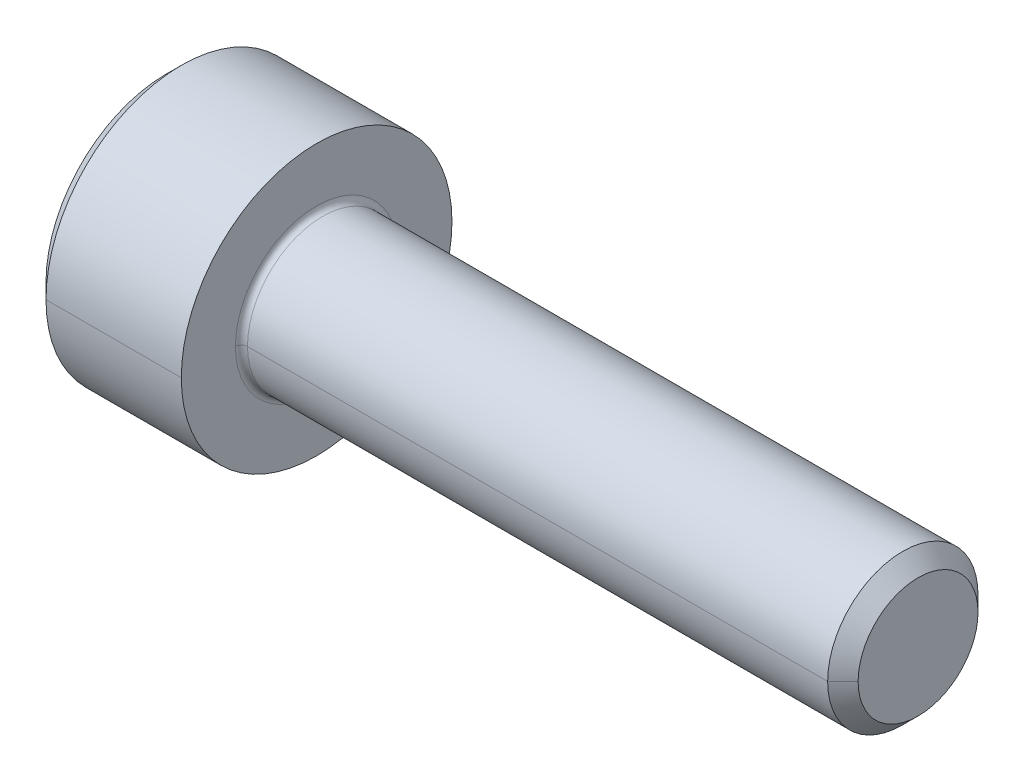
ISO-10303-21;
HEADER;
FILE_DESCRIPTION(('STEP AP214'),'2;1');
FILE_NAME('part.step','',(''),(''),'','','');
FILE_SCHEMA(('AUTOMOTIVE_DESIGN { 1 0 10303 214 1 1 1 1 }'));
ENDSEC;
DATA;
#1=APPLICATION_CONTEXT('core data for automotive mechanical design processes');
#2=APPLICATION_PROTOCOL_DEFINITION('international standard','automotive_design',2000,#1);
#3=PRODUCT_CONTEXT('',#1,'mechanical');
#4=PRODUCT('Part','Part','',(#3));
#5=PRODUCT_RELATED_PRODUCT_CATEGORY('part','',(#4));
#6=PRODUCT_DEFINITION_FORMATION('','',#4);
#7=PRODUCT_DEFINITION_CONTEXT('part definition',#1,'design');
#8=PRODUCT_DEFINITION('design','',#6,#7);
#9=PRODUCT_DEFINITION_SHAPE('','',#8);
#10=(LENGTH_UNIT() NAMED_UNIT(*) SI_UNIT(.MILLI.,.METRE.));
#11=(NAMED_UNIT(*) PLANE_ANGLE_UNIT() SI_UNIT($,.RADIAN.));
#12=(NAMED_UNIT(*) SI_UNIT($,.STERADIAN.) SOLID_ANGLE_UNIT());
#13=UNCERTAINTY_MEASURE_WITH_UNIT(LENGTH_MEASURE(1.E-05),#10,'distance_accuracy_value','');
#14=(GEOMETRIC_REPRESENTATION_CONTEXT(3) GLOBAL_UNCERTAINTY_ASSIGNED_CONTEXT((#13)) GLOBAL_UNIT_ASSIGNED_CONTEXT((#10,
#11,#12)) REPRESENTATION_CONTEXT('',''));
#15=CARTESIAN_POINT('',(0.,0.,0.));
#16=DIRECTION('',(0.,0.,1.));
#17=DIRECTION('',(1.,0.,0.));
#18=AXIS2_PLACEMENT_3D('',#15,#16,#17);
#19=CARTESIAN_POINT('',(1.1,0.,0.));
#20=DIRECTION('',(-1.,0.,0.));
#21=DIRECTION('',(0.,0.,1.));
#22=AXIS2_PLACEMENT_3D('',#19,#20,#21);
#23=CONICAL_SURFACE('',#22,1.0225,1.04719755119659);
#24=DIRECTION('',(-0.500000000000006,0.,-0.866025403784435));
#25=VECTOR('',#24,1.);
#26=CARTESIAN_POINT('',(1.1,0.,-1.0225));
#27=LINE('',#26,#25);
#28=CARTESIAN_POINT('',(1.6903406502464,0.,0.));
#29=VERTEX_POINT('',#28);
#30=CARTESIAN_POINT('',(1.1,0.,-1.0225));
#31=VERTEX_POINT('',#30);
#32=EDGE_CURVE('E173',#29,#31,#27,.T.);
#33=ORIENTED_EDGE('',*,*,#32,.F.);
#34=DIRECTION('',(-0.500000000000006,0.,0.866025403784435));
#35=VECTOR('',#34,1.);
#36=CARTESIAN_POINT('',(1.1,0.,1.0225));
#37=LINE('',#36,#35);
#38=CARTESIAN_POINT('',(1.1,0.,1.0225));
#39=VERTEX_POINT('',#38);
#40=EDGE_CURVE('E176',#29,#39,#37,.T.);
#41=ORIENTED_EDGE('',*,*,#40,.T.);
#42=CARTESIAN_POINT('',(1.1,0.,0.));
#43=DIRECTION('',(-1.,0.,0.));
#44=DIRECTION('',(0.,0.,1.));
#45=AXIS2_PLACEMENT_3D('',#42,#43,#44);
#46=CIRCLE('',#45,1.0225);
#47=CARTESIAN_POINT('',(1.1,0.885510975369586,0.51125));
#48=VERTEX_POINT('',#47);
#49=EDGE_CURVE('E196',#39,#48,#46,.T.);
#50=ORIENTED_EDGE('',*,*,#49,.T.);
#51=CARTESIAN_POINT('',(1.1,0.,0.));
#52=DIRECTION('',(-1.,0.,0.));
#53=DIRECTION('',(0.,0.,1.));
#54=AXIS2_PLACEMENT_3D('',#51,#52,#53);
#55=CIRCLE('',#54,1.0225);
#56=CARTESIAN_POINT('',(1.1,0.885510975369585,-0.51125));
#57=VERTEX_POINT('',#56);
#58=EDGE_CURVE('E25',#48,#57,#55,.T.);
#59=ORIENTED_EDGE('',*,*,#58,.T.);
#60=CARTESIAN_POINT('',(1.1,0.,0.));
#61=DIRECTION('',(-1.,0.,0.));
#62=DIRECTION('',(0.,0.,1.));
#63=AXIS2_PLACEMENT_3D('',#60,#61,#62);
#64=CIRCLE('',#63,1.0225);
#65=EDGE_CURVE('E11',#57,#31,#64,.T.);
#66=ORIENTED_EDGE('',*,*,#65,.T.);
#67=EDGE_LOOP('',(#33,#41,#50,#59,#66));
#68=FACE_BOUND('',#67,.T.);
#69=ADVANCED_FACE('F16',(#68),#23,.F.);
#70=CARTESIAN_POINT('',(1.1,1.77102195073917,-1.0225));
#71=DIRECTION('',(1.,0.,0.));
#72=DIRECTION('',(0.,1.,0.));
#73=AXIS2_PLACEMENT_3D('',#70,#71,#72);
#74=PLANE('',#73);
#75=DIRECTION('',(0.,-0.5,-0.866025403784438));
#76=VECTOR('',#75,1.);
#77=CARTESIAN_POINT('',(1.1,1.18068130049278,0.));
#78=LINE('',#77,#76);
#79=CARTESIAN_POINT('',(1.1,0.590340650246387,-1.0225));
#80=VERTEX_POINT('',#79);
#81=EDGE_CURVE('E44',#57,#80,#78,.T.);
#82=ORIENTED_EDGE('',*,*,#81,.T.);
#83=DIRECTION('',(0.,-1.,0.));
#84=VECTOR('',#83,1.);
#85=CARTESIAN_POINT('',(1.1,0.590340650246387,-1.0225));
#86=LINE('',#85,#84);
#87=EDGE_CURVE('E258',#80,#31,#86,.T.);
#88=ORIENTED_EDGE('',*,*,#87,.T.);
#89=ORIENTED_EDGE('',*,*,#65,.F.);
#90=EDGE_LOOP('',(#82,#88,#89));
#91=FACE_BOUND('',#90,.T.);
#92=ADVANCED_FACE('F416',(#91),#74,.F.);
#93=CARTESIAN_POINT('',(1.1,1.77102195073917,-1.0225));
#94=DIRECTION('',(1.,0.,0.));
#95=DIRECTION('',(0.,1.,0.));
#96=AXIS2_PLACEMENT_3D('',#93,#94,#95);
#97=PLANE('',#96);
#98=DIRECTION('',(0.,-0.5,0.86602540378444));
#99=VECTOR('',#98,1.);
#100=CARTESIAN_POINT('',(1.1,1.18068130049278,0.));
#101=LINE('',#100,#99);
#102=CARTESIAN_POINT('',(1.1,1.18068130049278,0.));
#103=VERTEX_POINT('',#102);
#104=EDGE_CURVE('E211',#103,#48,#101,.T.);
#105=ORIENTED_EDGE('',*,*,#104,.F.);
#106=DIRECTION('',(0.,-0.5,-0.866025403784438));
#107=VECTOR('',#106,1.);
#108=CARTESIAN_POINT('',(1.1,1.18068130049278,0.));
#109=LINE('',#108,#107);
#110=EDGE_CURVE('E199',#103,#57,#109,.T.);
#111=ORIENTED_EDGE('',*,*,#110,.T.);
#112=ORIENTED_EDGE('',*,*,#58,.F.);
#113=EDGE_LOOP('',(#105,#111,#112));
#114=FACE_BOUND('',#113,.T.);
#115=ADVANCED_FACE('F411',(#114),#97,.F.);
#116=CARTESIAN_POINT('',(1.1,1.77102195073917,-1.0225));
#117=DIRECTION('',(1.,0.,0.));
#118=DIRECTION('',(0.,1.,0.));
#119=AXIS2_PLACEMENT_3D('',#116,#117,#118);
#120=PLANE('',#119);
#121=DIRECTION('',(0.,1.,0.));
#122=VECTOR('',#121,1.);
#123=CARTESIAN_POINT('',(1.1,-0.590340650246394,1.0225));
#124=LINE('',#123,#122);
#125=CARTESIAN_POINT('',(1.1,0.590340650246391,1.0225));
#126=VERTEX_POINT('',#125);
#127=EDGE_CURVE('E342',#39,#126,#124,.T.);
#128=ORIENTED_EDGE('',*,*,#127,.T.);
#129=DIRECTION('',(0.,-0.5,0.86602540378444));
#130=VECTOR('',#129,1.);
#131=CARTESIAN_POINT('',(1.1,1.18068130049278,0.));
#132=LINE('',#131,#130);
#133=EDGE_CURVE('E206',#48,#126,#132,.T.);
#134=ORIENTED_EDGE('',*,*,#133,.F.);
#135=ORIENTED_EDGE('',*,*,#49,.F.);
#136=EDGE_LOOP('',(#128,#134,#135));
#137=FACE_BOUND('',#136,.T.);
#138=ADVANCED_FACE('F408',(#137),#120,.F.);
#139=CARTESIAN_POINT('',(1.1,1.77102195073917,-1.0225));
#140=DIRECTION('',(1.,0.,0.));
#141=DIRECTION('',(0.,1.,0.));
#142=AXIS2_PLACEMENT_3D('',#139,#140,#141);
#143=PLANE('',#142);
#144=DIRECTION('',(0.,-0.5,-0.866025403784438));
#145=VECTOR('',#144,1.);
#146=CARTESIAN_POINT('',(1.1,-0.590340650246394,1.0225));
#147=LINE('',#146,#145);
#148=CARTESIAN_POINT('',(1.1,-0.590340650246394,1.0225));
#149=VERTEX_POINT('',#148);
#150=CARTESIAN_POINT('',(1.1,-0.88551097536959,0.51125));
#151=VERTEX_POINT('',#150);
#152=EDGE_CURVE('E352',#149,#151,#147,.T.);
#153=ORIENTED_EDGE('',*,*,#152,.F.);
#154=DIRECTION('',(0.,1.,0.));
#155=VECTOR('',#154,1.);
#156=CARTESIAN_POINT('',(1.1,-0.590340650246394,1.0225));
#157=LINE('',#156,#155);
#158=EDGE_CURVE('E345',#149,#39,#157,.T.);
#159=ORIENTED_EDGE('',*,*,#158,.T.);
#160=CARTESIAN_POINT('',(1.1,0.,0.));
#161=DIRECTION('',(-1.,0.,0.));
#162=DIRECTION('',(0.,0.,1.));
#163=AXIS2_PLACEMENT_3D('',#160,#161,#162);
#164=CIRCLE('',#163,1.0225);
#165=EDGE_CURVE('E186',#151,#39,#164,.T.);
#166=ORIENTED_EDGE('',*,*,#165,.F.);
#167=EDGE_LOOP('',(#153,#159,#166));
#168=FACE_BOUND('',#167,.T.);
#169=ADVANCED_FACE('F401',(#168),#143,.F.);
#170=CARTESIAN_POINT('',(1.1,1.77102195073917,-1.0225));
#171=DIRECTION('',(1.,0.,0.));
#172=DIRECTION('',(0.,1.,0.));
#173=AXIS2_PLACEMENT_3D('',#170,#171,#172);
#174=PLANE('',#173);
#175=DIRECTION('',(0.,0.5,-0.86602540378444));
#176=VECTOR('',#175,1.);
#177=CARTESIAN_POINT('',(1.1,-1.18068130049279,0.));
#178=LINE('',#177,#176);
#179=CARTESIAN_POINT('',(1.1,-1.18068130049279,0.));
#180=VERTEX_POINT('',#179);
#181=CARTESIAN_POINT('',(1.1,-0.885510975369592,-0.51125));
#182=VERTEX_POINT('',#181);
#183=EDGE_CURVE('E363',#180,#182,#178,.T.);
#184=ORIENTED_EDGE('',*,*,#183,.F.);
#185=DIRECTION('',(0.,-0.5,-0.866025403784438));
#186=VECTOR('',#185,1.);
#187=CARTESIAN_POINT('',(1.1,-0.590340650246394,1.0225));
#188=LINE('',#187,#186);
#189=EDGE_CURVE('E356',#151,#180,#188,.T.);
#190=ORIENTED_EDGE('',*,*,#189,.F.);
#191=CARTESIAN_POINT('',(1.1,0.,0.));
#192=DIRECTION('',(-1.,0.,0.));
#193=DIRECTION('',(0.,0.,1.));
#194=AXIS2_PLACEMENT_3D('',#191,#192,#193);
#195=CIRCLE('',#194,1.0225);
#196=EDGE_CURVE('E195',#182,#151,#195,.T.);
#197=ORIENTED_EDGE('',*,*,#196,.F.);
#198=EDGE_LOOP('',(#184,#190,#197));
#199=FACE_BOUND('',#198,.T.);
#200=ADVANCED_FACE('F394',(#199),#174,.F.);
#201=CARTESIAN_POINT('',(1.1,1.77102195073917,-1.0225));
#202=DIRECTION('',(1.,0.,0.));
#203=DIRECTION('',(0.,1.,0.));
#204=AXIS2_PLACEMENT_3D('',#201,#202,#203);
#205=PLANE('',#204);
#206=DIRECTION('',(0.,-1.,0.));
#207=VECTOR('',#206,1.);
#208=CARTESIAN_POINT('',(1.1,0.590340650246387,-1.0225));
#209=LINE('',#208,#207);
#210=CARTESIAN_POINT('',(1.1,-0.590340650246397,-1.0225));
#211=VERTEX_POINT('',#210);
#212=EDGE_CURVE('E19',#31,#211,#209,.T.);
#213=ORIENTED_EDGE('',*,*,#212,.T.);
#214=DIRECTION('',(0.,0.5,-0.86602540378444));
#215=VECTOR('',#214,1.);
#216=CARTESIAN_POINT('',(1.1,-1.18068130049279,0.));
#217=LINE('',#216,#215);
#218=EDGE_CURVE('E367',#182,#211,#217,.T.);
#219=ORIENTED_EDGE('',*,*,#218,.F.);
#220=CARTESIAN_POINT('',(1.1,0.,0.));
#221=DIRECTION('',(-1.,0.,0.));
#222=DIRECTION('',(0.,0.,1.));
#223=AXIS2_PLACEMENT_3D('',#220,#221,#222);
#224=CIRCLE('',#223,1.0225);
#225=EDGE_CURVE('E180',#31,#182,#224,.T.);
#226=ORIENTED_EDGE('',*,*,#225,.F.);
#227=EDGE_LOOP('',(#213,#219,#226));
#228=FACE_BOUND('',#227,.T.);
#229=ADVANCED_FACE('F385',(#228),#205,.F.);
#230=CARTESIAN_POINT('',(1.1,1.18068130049278,0.));
#231=DIRECTION('',(0.,0.866025403784438,-0.5));
#232=DIRECTION('',(-1.,0.,0.));
#233=AXIS2_PLACEMENT_3D('',#230,#231,#232);
#234=PLANE('',#233);
#235=DIRECTION('',(0.,-0.5,-0.866025403784438));
#236=VECTOR('',#235,1.);
#237=CARTESIAN_POINT('',(0.,1.18068130049278,0.));
#238=LINE('',#237,#236);
#239=CARTESIAN_POINT('',(0.,1.18068130049278,0.));
#240=VERTEX_POINT('',#239);
#241=CARTESIAN_POINT('',(0.,0.590340650246387,-1.0225));
#242=VERTEX_POINT('',#241);
#243=EDGE_CURVE('E320',#240,#242,#238,.T.);
#244=ORIENTED_EDGE('',*,*,#243,.T.);
#245=DIRECTION('',(-1.,0.,0.));
#246=VECTOR('',#245,1.);
#247=CARTESIAN_POINT('',(1.1,0.590340650246387,-1.0225));
#248=LINE('',#247,#246);
#249=EDGE_CURVE('E255',#80,#242,#248,.T.);
#250=ORIENTED_EDGE('',*,*,#249,.F.);
#251=ORIENTED_EDGE('',*,*,#81,.F.);
#252=ORIENTED_EDGE('',*,*,#110,.F.);
#253=DIRECTION('',(-1.,0.,0.));
#254=VECTOR('',#253,1.);
#255=CARTESIAN_POINT('',(1.1,1.18068130049278,0.));
#256=LINE('',#255,#254);
#257=EDGE_CURVE('E334',#103,#240,#256,.T.);
#258=ORIENTED_EDGE('',*,*,#257,.T.);
#259=EDGE_LOOP('',(#244,#250,#251,#252,#258));
#260=FACE_BOUND('',#259,.T.);
#261=ADVANCED_FACE('F414',(#260),#234,.F.);
#262=CARTESIAN_POINT('',(1.1,0.590340650246387,-1.0225));
#263=DIRECTION('',(0.,0.,-1.));
#264=DIRECTION('',(0.,-1.,0.));
#265=AXIS2_PLACEMENT_3D('',#262,#263,#264);
#266=PLANE('',#265);
#267=DIRECTION('',(0.,-1.,0.));
#268=VECTOR('',#267,1.);
#269=CARTESIAN_POINT('',(0.,0.590340650246387,-1.0225));
#270=LINE('',#269,#268);
#271=CARTESIAN_POINT('',(0.,-0.590340650246397,-1.0225));
#272=VERTEX_POINT('',#271);
#273=EDGE_CURVE('E316',#242,#272,#270,.T.);
#274=ORIENTED_EDGE('',*,*,#273,.T.);
#275=DIRECTION('',(-1.,0.,0.));
#276=VECTOR('',#275,1.);
#277=CARTESIAN_POINT('',(1.1,-0.590340650246397,-1.0225));
#278=LINE('',#277,#276);
#279=EDGE_CURVE('E371',#211,#272,#278,.T.);
#280=ORIENTED_EDGE('',*,*,#279,.F.);
#281=ORIENTED_EDGE('',*,*,#212,.F.);
#282=ORIENTED_EDGE('',*,*,#87,.F.);
#283=ORIENTED_EDGE('',*,*,#249,.T.);
#284=EDGE_LOOP('',(#274,#280,#281,#282,#283));
#285=FACE_BOUND('',#284,.T.);
#286=ADVANCED_FACE('F388',(#285),#266,.F.);
#287=CARTESIAN_POINT('',(1.1,-1.18068130049279,0.));
#288=DIRECTION('',(0.,0.86602540378444,0.5));
#289=DIRECTION('',(1.,0.,0.));
#290=AXIS2_PLACEMENT_3D('',#287,#288,#289);
#291=PLANE('',#290);
#292=DIRECTION('',(0.,0.5,-0.86602540378444));
#293=VECTOR('',#292,1.);
#294=CARTESIAN_POINT('',(0.,-1.18068130049279,0.));
#295=LINE('',#294,#293);
#296=CARTESIAN_POINT('',(0.,-1.18068130049279,0.));
#297=VERTEX_POINT('',#296);
#298=EDGE_CURVE('E290',#297,#272,#295,.T.);
#299=ORIENTED_EDGE('',*,*,#298,.F.);
#300=DIRECTION('',(-1.,0.,0.));
#301=VECTOR('',#300,1.);
#302=CARTESIAN_POINT('',(1.1,-1.18068130049279,0.));
#303=LINE('',#302,#301);
#304=EDGE_CURVE('E360',#180,#297,#303,.T.);
#305=ORIENTED_EDGE('',*,*,#304,.F.);
#306=ORIENTED_EDGE('',*,*,#183,.T.);
#307=ORIENTED_EDGE('',*,*,#218,.T.);
#308=ORIENTED_EDGE('',*,*,#279,.T.);
#309=EDGE_LOOP('',(#299,#305,#306,#307,#308));
#310=FACE_BOUND('',#309,.T.);
#311=ADVANCED_FACE('F390',(#310),#291,.T.);
#312=CARTESIAN_POINT('',(1.1,-0.590340650246394,1.0225));
#313=DIRECTION('',(0.,0.866025403784438,-0.5));
#314=DIRECTION('',(-1.,0.,0.));
#315=AXIS2_PLACEMENT_3D('',#312,#313,#314);
#316=PLANE('',#315);
#317=DIRECTION('',(0.,-0.5,-0.866025403784438));
#318=VECTOR('',#317,1.);
#319=CARTESIAN_POINT('',(0.,-0.590340650246394,1.0225));
#320=LINE('',#319,#318);
#321=CARTESIAN_POINT('',(0.,-0.590340650246394,1.0225));
#322=VERTEX_POINT('',#321);
#323=EDGE_CURVE('E286',#322,#297,#320,.T.);
#324=ORIENTED_EDGE('',*,*,#323,.F.);
#325=DIRECTION('',(-1.,0.,0.));
#326=VECTOR('',#325,1.);
#327=CARTESIAN_POINT('',(1.1,-0.590340650246394,1.0225));
#328=LINE('',#327,#326);
#329=EDGE_CURVE('E349',#149,#322,#328,.T.);
#330=ORIENTED_EDGE('',*,*,#329,.F.);
#331=ORIENTED_EDGE('',*,*,#152,.T.);
#332=ORIENTED_EDGE('',*,*,#189,.T.);
#333=ORIENTED_EDGE('',*,*,#304,.T.);
#334=EDGE_LOOP('',(#324,#330,#331,#332,#333));
#335=FACE_BOUND('',#334,.T.);
#336=ADVANCED_FACE('F398',(#335),#316,.T.);
#337=CARTESIAN_POINT('',(1.1,-0.590340650246394,1.0225));
#338=DIRECTION('',(0.,0.,1.));
#339=DIRECTION('',(0.,-1.,0.));
#340=AXIS2_PLACEMENT_3D('',#337,#338,#339);
#341=PLANE('',#340);
#342=DIRECTION('',(0.,1.,0.));
#343=VECTOR('',#342,1.);
#344=CARTESIAN_POINT('',(0.,-0.590340650246394,1.0225));
#345=LINE('',#344,#343);
#346=CARTESIAN_POINT('',(0.,0.590340650246391,1.0225));
#347=VERTEX_POINT('',#346);
#348=EDGE_CURVE('E291',#322,#347,#345,.T.);
#349=ORIENTED_EDGE('',*,*,#348,.T.);
#350=DIRECTION('',(-1.,0.,0.));
#351=VECTOR('',#350,1.);
#352=CARTESIAN_POINT('',(1.1,0.590340650246391,1.0225));
#353=LINE('',#352,#351);
#354=EDGE_CURVE('E210',#126,#347,#353,.T.);
#355=ORIENTED_EDGE('',*,*,#354,.F.);
#356=ORIENTED_EDGE('',*,*,#127,.F.);
#357=ORIENTED_EDGE('',*,*,#158,.F.);
#358=ORIENTED_EDGE('',*,*,#329,.T.);
#359=EDGE_LOOP('',(#349,#355,#356,#357,#358));
#360=FACE_BOUND('',#359,.T.);
#361=ADVANCED_FACE('F405',(#360),#341,.F.);
#362=CARTESIAN_POINT('',(1.1,1.18068130049278,0.));
#363=DIRECTION('',(0.,-0.86602540378444,-0.5));
#364=DIRECTION('',(0.,0.5,-0.86602540378444));
#365=AXIS2_PLACEMENT_3D('',#362,#363,#364);
#366=PLANE('',#365);
#367=DIRECTION('',(0.,-0.5,0.86602540378444));
#368=VECTOR('',#367,1.);
#369=CARTESIAN_POINT('',(0.,1.18068130049278,0.));
#370=LINE('',#369,#368);
#371=EDGE_CURVE('E306',#240,#347,#370,.T.);
#372=ORIENTED_EDGE('',*,*,#371,.F.);
#373=ORIENTED_EDGE('',*,*,#257,.F.);
#374=ORIENTED_EDGE('',*,*,#104,.T.);
#375=ORIENTED_EDGE('',*,*,#133,.T.);
#376=ORIENTED_EDGE('',*,*,#354,.T.);
#377=EDGE_LOOP('',(#372,#373,#374,#375,#376));
#378=FACE_BOUND('',#377,.T.);
#379=ADVANCED_FACE('F442',(#378),#366,.T.);
#380=CARTESIAN_POINT('',(2.6,0.,0.));
#381=DIRECTION('',(1.,0.,0.));
#382=DIRECTION('',(0.,0.,-1.));
#383=AXIS2_PLACEMENT_3D('',#380,#381,#382);
#384=TOROIDAL_SURFACE('',#383,1.34999999999998,0.1);
#385=CARTESIAN_POINT('',(2.6,0.,1.34999999999998));
#386=DIRECTION('',(0.,1.,0.));
#387=DIRECTION('',(0.,0.,1.));
#388=AXIS2_PLACEMENT_3D('',#385,#386,#387);
#389=CIRCLE('',#388,0.1);
#390=CARTESIAN_POINT('',(2.6,0.,1.24999999999998));
#391=VERTEX_POINT('',#390);
#392=CARTESIAN_POINT('',(2.5,0.,1.34999999999998));
#393=VERTEX_POINT('',#392);
#394=EDGE_CURVE('E229',#391,#393,#389,.T.);
#395=ORIENTED_EDGE('',*,*,#394,.F.);
#396=CARTESIAN_POINT('',(2.6,0.,0.));
#397=DIRECTION('',(1.,0.,0.));
#398=DIRECTION('',(0.,0.,-1.));
#399=AXIS2_PLACEMENT_3D('',#396,#397,#398);
#400=CIRCLE('',#399,1.24999999999998);
#401=CARTESIAN_POINT('',(2.6,0.,-1.24999999999998));
#402=VERTEX_POINT('',#401);
#403=EDGE_CURVE('E274',#402,#391,#400,.T.);
#404=ORIENTED_EDGE('',*,*,#403,.F.);
#405=CARTESIAN_POINT('',(2.6,0.,-1.34999999999998));
#406=DIRECTION('',(0.,-1.,0.));
#407=DIRECTION('',(0.,0.,-1.));
#408=AXIS2_PLACEMENT_3D('',#405,#406,#407);
#409=CIRCLE('',#408,0.1);
#410=CARTESIAN_POINT('',(2.5,0.,-1.34999999999998));
#411=VERTEX_POINT('',#410);
#412=EDGE_CURVE('E225',#402,#411,#409,.T.);
#413=ORIENTED_EDGE('',*,*,#412,.T.);
#414=CARTESIAN_POINT('',(2.5,0.,0.));
#415=DIRECTION('',(-1.,0.,0.));
#416=DIRECTION('',(0.,0.,-1.));
#417=AXIS2_PLACEMENT_3D('',#414,#415,#416);
#418=CIRCLE('',#417,1.34999999999998);
#419=EDGE_CURVE('E279',#393,#411,#418,.T.);
#420=ORIENTED_EDGE('',*,*,#419,.F.);
#421=EDGE_LOOP('',(#395,#404,#413,#420));
#422=FACE_BOUND('',#421,.T.);
#423=ADVANCED_FACE('F445',(#422),#384,.F.);
#424=CARTESIAN_POINT('',(0.,0.,0.));
#425=DIRECTION('',(1.,0.,0.));
#426=DIRECTION('',(0.,0.,-1.));
#427=AXIS2_PLACEMENT_3D('',#424,#425,#426);
#428=CONICAL_SURFACE('',#427,2.,0.785398163397448);
#429=DIRECTION('',(0.707106781186548,0.,0.707106781186548));
#430=VECTOR('',#429,1.);
#431=CARTESIAN_POINT('',(0.,0.,2.));
#432=LINE('',#431,#430);
#433=CARTESIAN_POINT('',(0.,0.,2.));
#434=VERTEX_POINT('',#433);
#435=CARTESIAN_POINT('',(0.25,0.,2.25));
#436=VERTEX_POINT('',#435);
#437=EDGE_CURVE('E224',#434,#436,#432,.T.);
#438=ORIENTED_EDGE('',*,*,#437,.F.);
#439=CARTESIAN_POINT('',(0.,0.,0.));
#440=DIRECTION('',(-1.,0.,0.));
#441=DIRECTION('',(0.,0.,1.));
#442=AXIS2_PLACEMENT_3D('',#439,#440,#441);
#443=CIRCLE('',#442,2.);
#444=CARTESIAN_POINT('',(0.,0.,-2.));
#445=VERTEX_POINT('',#444);
#446=EDGE_CURVE('E303',#445,#434,#443,.T.);
#447=ORIENTED_EDGE('',*,*,#446,.F.);
#448=DIRECTION('',(0.707106781186548,0.,-0.707106781186548));
#449=VECTOR('',#448,1.);
#450=CARTESIAN_POINT('',(0.,0.,-2.));
#451=LINE('',#450,#449);
#452=CARTESIAN_POINT('',(0.25,0.,-2.25));
#453=VERTEX_POINT('',#452);
#454=EDGE_CURVE('E205',#445,#453,#451,.T.);
#455=ORIENTED_EDGE('',*,*,#454,.T.);
#456=CARTESIAN_POINT('',(0.25,0.,0.));
#457=DIRECTION('',(-1.,0.,0.));
#458=DIRECTION('',(0.,0.,1.));
#459=AXIS2_PLACEMENT_3D('',#456,#457,#458);
#460=CIRCLE('',#459,2.25);
#461=EDGE_CURVE('E282',#453,#436,#460,.T.);
#462=ORIENTED_EDGE('',*,*,#461,.T.);
#463=EDGE_LOOP('',(#438,#447,#455,#462));
#464=FACE_BOUND('',#463,.T.);
#465=ADVANCED_FACE('F451',(#464),#428,.T.);
#466=CARTESIAN_POINT('',(-31.75,0.,0.));
#467=DIRECTION('',(-1.,0.,0.));
#468=DIRECTION('',(0.,0.,1.));
#469=AXIS2_PLACEMENT_3D('',#466,#467,#468);
#470=CYLINDRICAL_SURFACE('',#469,2.25);
#471=DIRECTION('',(-1.,0.,0.));
#472=VECTOR('',#471,1.);
#473=CARTESIAN_POINT('',(-31.75,0.,-2.25));
#474=LINE('',#473,#472);
#475=CARTESIAN_POINT('',(2.5,0.,-2.25));
#476=VERTEX_POINT('',#475);
#477=EDGE_CURVE('E204',#476,#453,#474,.T.);
#478=ORIENTED_EDGE('',*,*,#477,.F.);
#479=CARTESIAN_POINT('',(2.5,0.,0.));
#480=DIRECTION('',(-1.,0.,0.));
#481=DIRECTION('',(0.,0.,1.));
#482=AXIS2_PLACEMENT_3D('',#479,#480,#481);
#483=CIRCLE('',#482,2.25);
#484=CARTESIAN_POINT('',(2.5,0.,2.25));
#485=VERTEX_POINT('',#484);
#486=EDGE_CURVE('E265',#476,#485,#483,.T.);
#487=ORIENTED_EDGE('',*,*,#486,.T.);
#488=DIRECTION('',(-1.,0.,0.));
#489=VECTOR('',#488,1.);
#490=CARTESIAN_POINT('',(-31.75,0.,2.25));
#491=LINE('',#490,#489);
#492=EDGE_CURVE('E244',#485,#436,#491,.T.);
#493=ORIENTED_EDGE('',*,*,#492,.T.);
#494=ORIENTED_EDGE('',*,*,#461,.F.);
#495=EDGE_LOOP('',(#478,#487,#493,#494));
#496=FACE_BOUND('',#495,.T.);
#497=ADVANCED_FACE('F447',(#496),#470,.T.);
#498=CARTESIAN_POINT('',(2.5,2.25,0.));
#499=DIRECTION('',(1.,0.,0.));
#500=DIRECTION('',(0.,1.,0.));
#501=AXIS2_PLACEMENT_3D('',#498,#499,#500);
#502=PLANE('',#501);
#503=CARTESIAN_POINT('',(2.5,0.,0.));
#504=DIRECTION('',(-1.,0.,0.));
#505=DIRECTION('',(0.,0.,-1.));
#506=AXIS2_PLACEMENT_3D('',#503,#504,#505);
#507=CIRCLE('',#506,1.34999999999998);
#508=EDGE_CURVE('E233',#411,#393,#507,.T.);
#509=ORIENTED_EDGE('',*,*,#508,.T.);
#510=ORIENTED_EDGE('',*,*,#419,.T.);
#511=EDGE_LOOP('',(#509,#510));
#512=FACE_BOUND('',#511,.T.);
#513=CARTESIAN_POINT('',(2.5,0.,0.));
#514=DIRECTION('',(-1.,0.,0.));
#515=DIRECTION('',(0.,0.,1.));
#516=AXIS2_PLACEMENT_3D('',#513,#514,#515);
#517=CIRCLE('',#516,2.25);
#518=EDGE_CURVE('E200',#485,#476,#517,.T.);
#519=ORIENTED_EDGE('',*,*,#518,.F.);
#520=ORIENTED_EDGE('',*,*,#486,.F.);
#521=EDGE_LOOP('',(#519,#520));
#522=FACE_BOUND('',#521,.T.);
#523=ADVANCED_FACE('F450',(#512,#522),#502,.T.);
#524=CARTESIAN_POINT('',(-31.75,0.,0.));
#525=DIRECTION('',(-1.,0.,0.));
#526=DIRECTION('',(0.,0.,1.));
#527=AXIS2_PLACEMENT_3D('',#524,#525,#526);
#528=CYLINDRICAL_SURFACE('',#527,1.24999999999998);
#529=DIRECTION('',(-1.,0.,0.));
#530=VECTOR('',#529,1.);
#531=CARTESIAN_POINT('',(-31.75,0.,-1.24999999999998));
#532=LINE('',#531,#530);
#533=CARTESIAN_POINT('',(12.2465,0.,-1.24999999999996));
#534=VERTEX_POINT('',#533);
#535=EDGE_CURVE('E270',#534,#402,#532,.T.);
#536=ORIENTED_EDGE('',*,*,#535,.F.);
#537=CARTESIAN_POINT('',(12.2465,0.,0.));
#538=DIRECTION('',(-1.,0.,0.));
#539=DIRECTION('',(0.,0.,1.));
#540=AXIS2_PLACEMENT_3D('',#537,#538,#539);
#541=CIRCLE('',#540,1.24999999999996);
#542=CARTESIAN_POINT('',(12.2465,0.,1.24999999999996));
#543=VERTEX_POINT('',#542);
#544=EDGE_CURVE('E262',#534,#543,#541,.T.);
#545=ORIENTED_EDGE('',*,*,#544,.T.);
#546=DIRECTION('',(-1.,0.,0.));
#547=VECTOR('',#546,1.);
#548=CARTESIAN_POINT('',(-31.75,0.,1.24999999999998));
#549=LINE('',#548,#547);
#550=EDGE_CURVE('E278',#543,#391,#549,.T.);
#551=ORIENTED_EDGE('',*,*,#550,.T.);
#552=CARTESIAN_POINT('',(2.6,0.,0.));
#553=DIRECTION('',(1.,0.,0.));
#554=DIRECTION('',(0.,0.,-1.));
#555=AXIS2_PLACEMENT_3D('',#552,#553,#554);
#556=CIRCLE('',#555,1.24999999999998);
#557=EDGE_CURVE('E216',#391,#402,#556,.T.);
#558=ORIENTED_EDGE('',*,*,#557,.T.);
#559=EDGE_LOOP('',(#536,#545,#551,#558));
#560=FACE_BOUND('',#559,.T.);
#561=ADVANCED_FACE('F457',(#560),#528,.T.);
#562=CARTESIAN_POINT('',(12.5,0.,0.));
#563=DIRECTION('',(-1.,0.,0.));
#564=DIRECTION('',(0.,0.,1.));
#565=AXIS2_PLACEMENT_3D('',#562,#563,#564);
#566=CONICAL_SURFACE('',#565,0.9965,0.785398163397327);
#567=DIRECTION('',(-0.707106781186633,0.,-0.707106781186462));
#568=VECTOR('',#567,1.);
#569=CARTESIAN_POINT('',(12.5,0.,-0.9965));
#570=LINE('',#569,#568);
#571=CARTESIAN_POINT('',(12.5,0.,-0.9965));
#572=VERTEX_POINT('',#571);
#573=EDGE_CURVE('E295',#572,#534,#570,.T.);
#574=ORIENTED_EDGE('',*,*,#573,.F.);
#575=CARTESIAN_POINT('',(12.5,0.,0.));
#576=DIRECTION('',(-1.,0.,0.));
#577=DIRECTION('',(0.,0.,1.));
#578=AXIS2_PLACEMENT_3D('',#575,#576,#577);
#579=CIRCLE('',#578,0.9965);
#580=CARTESIAN_POINT('',(12.5,0.,0.9965));
#581=VERTEX_POINT('',#580);
#582=EDGE_CURVE('E266',#572,#581,#579,.T.);
#583=ORIENTED_EDGE('',*,*,#582,.T.);
#584=DIRECTION('',(-0.707106781186633,0.,0.707106781186462));
#585=VECTOR('',#584,1.);
#586=CARTESIAN_POINT('',(12.5,0.,0.9965));
#587=LINE('',#586,#585);
#588=EDGE_CURVE('E299',#581,#543,#587,.T.);
#589=ORIENTED_EDGE('',*,*,#588,.T.);
#590=ORIENTED_EDGE('',*,*,#544,.F.);
#591=EDGE_LOOP('',(#574,#583,#589,#590));
#592=FACE_BOUND('',#591,.T.);
#593=ADVANCED_FACE('F453',(#592),#566,.T.);
#594=CARTESIAN_POINT('',(12.5,0.9965,0.));
#595=DIRECTION('',(1.,0.,0.));
#596=DIRECTION('',(0.,1.,0.));
#597=AXIS2_PLACEMENT_3D('',#594,#595,#596);
#598=PLANE('',#597);
#599=CARTESIAN_POINT('',(12.5,0.,0.));
#600=DIRECTION('',(-1.,0.,0.));
#601=DIRECTION('',(0.,0.,1.));
#602=AXIS2_PLACEMENT_3D('',#599,#600,#601);
#603=CIRCLE('',#602,0.9965);
#604=EDGE_CURVE('E285',#581,#572,#603,.T.);
#605=ORIENTED_EDGE('',*,*,#604,.F.);
#606=ORIENTED_EDGE('',*,*,#582,.F.);
#607=EDGE_LOOP('',(#605,#606));
#608=FACE_BOUND('',#607,.T.);
#609=ADVANCED_FACE('F456',(#608),#598,.T.);
#610=CARTESIAN_POINT('',(0.,0.,0.));
#611=DIRECTION('',(-1.,0.,0.));
#612=DIRECTION('',(0.,0.,1.));
#613=AXIS2_PLACEMENT_3D('',#610,#611,#612);
#614=PLANE('',#613);
#615=ORIENTED_EDGE('',*,*,#371,.T.);
#616=ORIENTED_EDGE('',*,*,#348,.F.);
#617=ORIENTED_EDGE('',*,*,#323,.T.);
#618=ORIENTED_EDGE('',*,*,#298,.T.);
#619=ORIENTED_EDGE('',*,*,#273,.F.);
#620=ORIENTED_EDGE('',*,*,#243,.F.);
#621=EDGE_LOOP('',(#615,#616,#617,#618,#619,#620));
#622=FACE_BOUND('',#621,.T.);
#623=ORIENTED_EDGE('',*,*,#446,.T.);
#624=CARTESIAN_POINT('',(0.,0.,0.));
#625=DIRECTION('',(-1.,0.,0.));
#626=DIRECTION('',(0.,0.,1.));
#627=AXIS2_PLACEMENT_3D('',#624,#625,#626);
#628=CIRCLE('',#627,2.);
#629=EDGE_CURVE('E220',#434,#445,#628,.T.);
#630=ORIENTED_EDGE('',*,*,#629,.T.);
#631=EDGE_LOOP('',(#623,#630));
#632=FACE_BOUND('',#631,.T.);
#633=ADVANCED_FACE('F469',(#622,#632),#614,.T.);
#634=CARTESIAN_POINT('',(12.5,0.,0.));
#635=DIRECTION('',(-1.,0.,0.));
#636=DIRECTION('',(0.,0.,1.));
#637=AXIS2_PLACEMENT_3D('',#634,#635,#636);
#638=CONICAL_SURFACE('',#637,0.9965,0.785398163397327);
#639=ORIENTED_EDGE('',*,*,#604,.T.);
#640=ORIENTED_EDGE('',*,*,#573,.T.);
#641=CARTESIAN_POINT('',(12.2465,0.,0.));
#642=DIRECTION('',(-1.,0.,0.));
#643=DIRECTION('',(0.,0.,1.));
#644=AXIS2_PLACEMENT_3D('',#641,#642,#643);
#645=CIRCLE('',#644,1.24999999999996);
#646=EDGE_CURVE('E248',#543,#534,#645,.T.);
#647=ORIENTED_EDGE('',*,*,#646,.F.);
#648=ORIENTED_EDGE('',*,*,#588,.F.);
#649=EDGE_LOOP('',(#639,#640,#647,#648));
#650=FACE_BOUND('',#649,.T.);
#651=ADVANCED_FACE('F473',(#650),#638,.T.);
#652=CARTESIAN_POINT('',(-31.75,0.,0.));
#653=DIRECTION('',(-1.,0.,0.));
#654=DIRECTION('',(0.,0.,1.));
#655=AXIS2_PLACEMENT_3D('',#652,#653,#654);
#656=CYLINDRICAL_SURFACE('',#655,1.24999999999998);
#657=ORIENTED_EDGE('',*,*,#646,.T.);
#658=ORIENTED_EDGE('',*,*,#535,.T.);
#659=ORIENTED_EDGE('',*,*,#403,.T.);
#660=ORIENTED_EDGE('',*,*,#550,.F.);
#661=EDGE_LOOP('',(#657,#658,#659,#660));
#662=FACE_BOUND('',#661,.T.);
#663=ADVANCED_FACE('F477',(#662),#656,.T.);
#664=CARTESIAN_POINT('',(-31.75,0.,0.));
#665=DIRECTION('',(-1.,0.,0.));
#666=DIRECTION('',(0.,0.,1.));
#667=AXIS2_PLACEMENT_3D('',#664,#665,#666);
#668=CYLINDRICAL_SURFACE('',#667,2.25);
#669=ORIENTED_EDGE('',*,*,#518,.T.);
#670=ORIENTED_EDGE('',*,*,#477,.T.);
#671=CARTESIAN_POINT('',(0.25,0.,0.));
#672=DIRECTION('',(-1.,0.,0.));
#673=DIRECTION('',(0.,0.,1.));
#674=AXIS2_PLACEMENT_3D('',#671,#672,#673);
#675=CIRCLE('',#674,2.25);
#676=EDGE_CURVE('E243',#436,#453,#675,.T.);
#677=ORIENTED_EDGE('',*,*,#676,.F.);
#678=ORIENTED_EDGE('',*,*,#492,.F.);
#679=EDGE_LOOP('',(#669,#670,#677,#678));
#680=FACE_BOUND('',#679,.T.);
#681=ADVANCED_FACE('F481',(#680),#668,.T.);
#682=CARTESIAN_POINT('',(0.,0.,0.));
#683=DIRECTION('',(1.,0.,0.));
#684=DIRECTION('',(0.,0.,-1.));
#685=AXIS2_PLACEMENT_3D('',#682,#683,#684);
#686=CONICAL_SURFACE('',#685,2.,0.785398163397448);
#687=ORIENTED_EDGE('',*,*,#629,.F.);
#688=ORIENTED_EDGE('',*,*,#437,.T.);
#689=ORIENTED_EDGE('',*,*,#676,.T.);
#690=ORIENTED_EDGE('',*,*,#454,.F.);
#691=EDGE_LOOP('',(#687,#688,#689,#690));
#692=FACE_BOUND('',#691,.T.);
#693=ADVANCED_FACE('F485',(#692),#686,.T.);
#694=CARTESIAN_POINT('',(2.6,0.,0.));
#695=DIRECTION('',(1.,0.,0.));
#696=DIRECTION('',(0.,0.,-1.));
#697=AXIS2_PLACEMENT_3D('',#694,#695,#696);
#698=TOROIDAL_SURFACE('',#697,1.34999999999998,0.1);
#699=ORIENTED_EDGE('',*,*,#557,.F.);
#700=ORIENTED_EDGE('',*,*,#394,.T.);
#701=ORIENTED_EDGE('',*,*,#508,.F.);
#702=ORIENTED_EDGE('',*,*,#412,.F.);
#703=EDGE_LOOP('',(#699,#700,#701,#702));
#704=FACE_BOUND('',#703,.T.);
#705=ADVANCED_FACE('F489',(#704),#698,.F.);
#706=CARTESIAN_POINT('',(1.1,0.,0.));
#707=DIRECTION('',(-1.,0.,0.));
#708=DIRECTION('',(0.,0.,1.));
#709=AXIS2_PLACEMENT_3D('',#706,#707,#708);
#710=CONICAL_SURFACE('',#709,1.0225,1.04719755119659);
#711=ORIENTED_EDGE('',*,*,#40,.F.);
#712=ORIENTED_EDGE('',*,*,#32,.T.);
#713=ORIENTED_EDGE('',*,*,#225,.T.);
#714=ORIENTED_EDGE('',*,*,#196,.T.);
#715=ORIENTED_EDGE('',*,*,#165,.T.);
#716=EDGE_LOOP('',(#711,#712,#713,#714,#715));
#717=FACE_BOUND('',#716,.T.);
#718=ADVANCED_FACE('F183',(#717),#710,.F.);
#719=CLOSED_SHELL('',(#69,#92,#115,#138,#169,#200,#229,#261,#286,#311,#336,#361,#379,#423,#465,
#497,#523,#561,#593,#609,#633,#651,#663,#681,#693,#705,#718));
#720=MANIFOLD_SOLID_BREP('B1',#719);
#721=ADVANCED_BREP_SHAPE_REPRESENTATION('',(#18,#720),#14);
#722=SHAPE_DEFINITION_REPRESENTATION(#9,#721);
ENDSEC;
END-ISO-10303-21;
